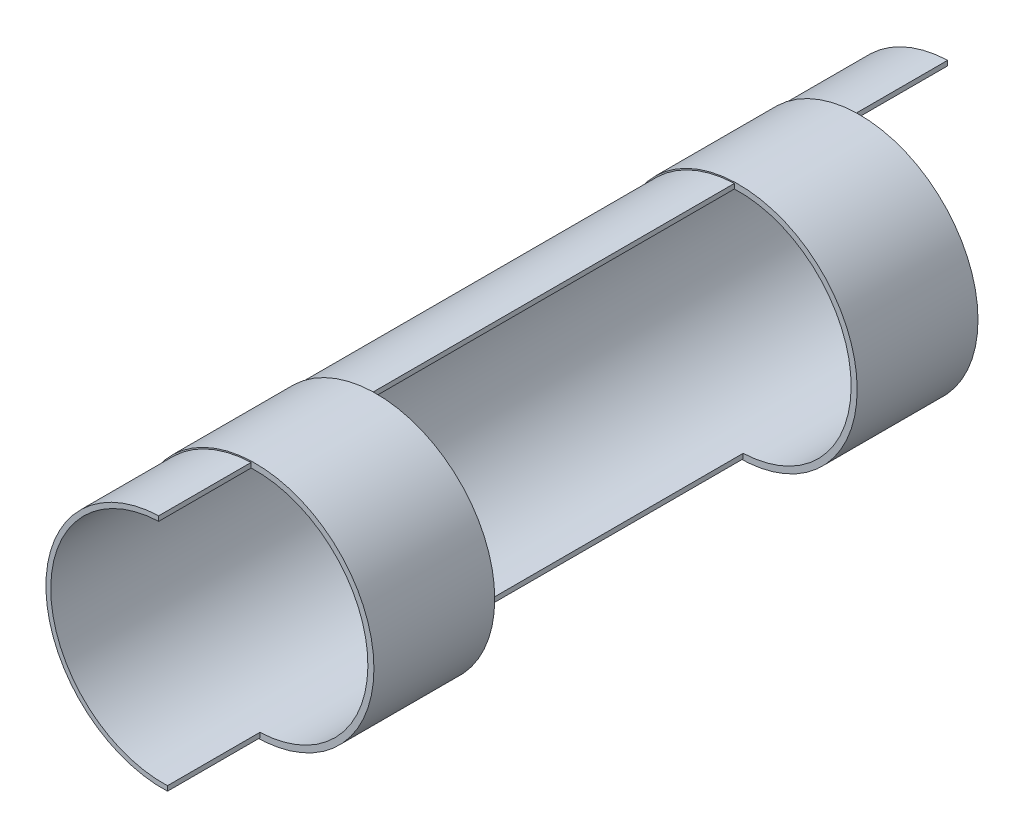
ISO-10303-21;
HEADER;
FILE_DESCRIPTION(('STEP AP214'),'2;1');
FILE_NAME('part.step','',(''),(''),'','','');
FILE_SCHEMA(('AUTOMOTIVE_DESIGN { 1 0 10303 214 1 1 1 1 }'));
ENDSEC;
DATA;
#1=APPLICATION_CONTEXT('core data for automotive mechanical design processes');
#2=APPLICATION_PROTOCOL_DEFINITION('international standard','automotive_design',2000,#1);
#3=PRODUCT_CONTEXT('',#1,'mechanical');
#4=PRODUCT('Part','Part','',(#3));
#5=PRODUCT_RELATED_PRODUCT_CATEGORY('part','',(#4));
#6=PRODUCT_DEFINITION_FORMATION('','',#4);
#7=PRODUCT_DEFINITION_CONTEXT('part definition',#1,'design');
#8=PRODUCT_DEFINITION('design','',#6,#7);
#9=PRODUCT_DEFINITION_SHAPE('','',#8);
#10=(LENGTH_UNIT() NAMED_UNIT(*) SI_UNIT(.MILLI.,.METRE.));
#11=(NAMED_UNIT(*) PLANE_ANGLE_UNIT() SI_UNIT($,.RADIAN.));
#12=(NAMED_UNIT(*) SI_UNIT($,.STERADIAN.) SOLID_ANGLE_UNIT());
#13=UNCERTAINTY_MEASURE_WITH_UNIT(LENGTH_MEASURE(1.E-05),#10,'distance_accuracy_value','');
#14=(GEOMETRIC_REPRESENTATION_CONTEXT(3) GLOBAL_UNCERTAINTY_ASSIGNED_CONTEXT((#13)) GLOBAL_UNIT_ASSIGNED_CONTEXT((#10,
#11,#12)) REPRESENTATION_CONTEXT('',''));
#15=CARTESIAN_POINT('',(0.,0.,0.));
#16=DIRECTION('',(0.,0.,1.));
#17=DIRECTION('',(1.,0.,0.));
#18=AXIS2_PLACEMENT_3D('',#15,#16,#17);
#19=CARTESIAN_POINT('',(-0.361769768121218,9.69325139645483,32.65));
#20=DIRECTION('',(1.,0.,0.));
#21=DIRECTION('',(0.,0.,-1.));
#22=AXIS2_PLACEMENT_3D('',#19,#20,#21);
#23=PLANE('',#22);
#24=DIRECTION('',(0.,0.,-1.));
#25=VECTOR('',#24,1.);
#26=CARTESIAN_POINT('',(-0.361769768121218,9.69325139645483,32.65));
#27=LINE('',#26,#25);
#28=CARTESIAN_POINT('',(-0.361769768121218,9.69325139645483,-25.));
#29=VERTEX_POINT('',#28);
#30=CARTESIAN_POINT('',(-0.361769768121218,9.69325139645483,-32.65));
#31=VERTEX_POINT('',#30);
#32=EDGE_CURVE('E48',#29,#31,#27,.T.);
#33=ORIENTED_EDGE('',*,*,#32,.F.);
#34=DIRECTION('',(0.,-1.,0.));
#35=VECTOR('',#34,1.);
#36=CARTESIAN_POINT('',(-0.361769768121218,9.69325139645483,-25.));
#37=LINE('',#36,#35);
#38=CARTESIAN_POINT('',(-0.361769768121218,9.29296091861327,-25.));
#39=VERTEX_POINT('',#38);
#40=EDGE_CURVE('E131',#29,#39,#37,.T.);
#41=ORIENTED_EDGE('',*,*,#40,.T.);
#42=DIRECTION('',(0.,0.,-1.));
#43=VECTOR('',#42,1.);
#44=CARTESIAN_POINT('',(-0.361769768121218,9.29296091861327,32.65));
#45=LINE('',#44,#43);
#46=CARTESIAN_POINT('',(-0.361769768121218,9.29296091861327,-32.65));
#47=VERTEX_POINT('',#46);
#48=EDGE_CURVE('E141',#39,#47,#45,.T.);
#49=ORIENTED_EDGE('',*,*,#48,.T.);
#50=DIRECTION('',(0.,-1.,0.));
#51=VECTOR('',#50,1.);
#52=CARTESIAN_POINT('',(-0.361769768121218,9.69325139645483,-32.65));
#53=LINE('',#52,#51);
#54=EDGE_CURVE('E191',#31,#47,#53,.T.);
#55=ORIENTED_EDGE('',*,*,#54,.F.);
#56=EDGE_LOOP('',(#33,#41,#49,#55));
#57=FACE_BOUND('',#56,.T.);
#58=ADVANCED_FACE('F37',(#57),#23,.T.);
#59=CARTESIAN_POINT('',(0.,0.,32.65));
#60=DIRECTION('',(0.,0.,-1.));
#61=DIRECTION('',(-1.,0.,0.));
#62=AXIS2_PLACEMENT_3D('',#59,#60,#61);
#63=CYLINDRICAL_SURFACE('',#62,9.7);
#64=CARTESIAN_POINT('',(0.,0.,-25.));
#65=DIRECTION('',(0.,0.,1.));
#66=DIRECTION('',(1.,0.,0.));
#67=AXIS2_PLACEMENT_3D('',#64,#65,#66);
#68=CIRCLE('',#67,9.7);
#69=CARTESIAN_POINT('',(0.361769768121218,-9.69325139645483,-25.));
#70=VERTEX_POINT('',#69);
#71=EDGE_CURVE('E144',#29,#70,#68,.T.);
#72=ORIENTED_EDGE('',*,*,#71,.F.);
#73=ORIENTED_EDGE('',*,*,#32,.T.);
#74=CARTESIAN_POINT('',(0.,0.,-32.65));
#75=DIRECTION('',(0.,0.,1.));
#76=DIRECTION('',(1.,0.,0.));
#77=AXIS2_PLACEMENT_3D('',#74,#75,#76);
#78=CIRCLE('',#77,9.7);
#79=CARTESIAN_POINT('',(0.361769768121218,-9.69325139645483,-32.65));
#80=VERTEX_POINT('',#79);
#81=EDGE_CURVE('E184',#31,#80,#78,.T.);
#82=ORIENTED_EDGE('',*,*,#81,.T.);
#83=DIRECTION('',(0.,0.,-1.));
#84=VECTOR('',#83,1.);
#85=CARTESIAN_POINT('',(0.361769768121218,-9.69325139645483,32.65));
#86=LINE('',#85,#84);
#87=EDGE_CURVE('E165',#70,#80,#86,.T.);
#88=ORIENTED_EDGE('',*,*,#87,.F.);
#89=EDGE_LOOP('',(#72,#73,#82,#88));
#90=FACE_BOUND('',#89,.T.);
#91=ADVANCED_FACE('F266',(#90),#63,.T.);
#92=CARTESIAN_POINT('',(0.361769768121218,-9.29296091861327,32.65));
#93=DIRECTION('',(1.,0.,0.));
#94=DIRECTION('',(0.,1.,0.));
#95=AXIS2_PLACEMENT_3D('',#92,#93,#94);
#96=PLANE('',#95);
#97=DIRECTION('',(0.,0.,-1.));
#98=VECTOR('',#97,1.);
#99=CARTESIAN_POINT('',(0.361769768121213,-9.29296091861327,32.65));
#100=LINE('',#99,#98);
#101=CARTESIAN_POINT('',(0.361769768121213,-9.29296091861327,-25.));
#102=VERTEX_POINT('',#101);
#103=CARTESIAN_POINT('',(0.361769768121213,-9.29296091861327,-32.65));
#104=VERTEX_POINT('',#103);
#105=EDGE_CURVE('E156',#102,#104,#100,.T.);
#106=ORIENTED_EDGE('',*,*,#105,.F.);
#107=DIRECTION('',(0.,-1.,0.));
#108=VECTOR('',#107,1.);
#109=CARTESIAN_POINT('',(0.361769768121218,-9.29296091861327,-25.));
#110=LINE('',#109,#108);
#111=EDGE_CURVE('E134',#102,#70,#110,.T.);
#112=ORIENTED_EDGE('',*,*,#111,.T.);
#113=ORIENTED_EDGE('',*,*,#87,.T.);
#114=DIRECTION('',(0.,-1.,0.));
#115=VECTOR('',#114,1.);
#116=CARTESIAN_POINT('',(0.361769768121218,-9.29296091861327,-32.65));
#117=LINE('',#116,#115);
#118=EDGE_CURVE('E187',#104,#80,#117,.T.);
#119=ORIENTED_EDGE('',*,*,#118,.F.);
#120=EDGE_LOOP('',(#106,#112,#113,#119));
#121=FACE_BOUND('',#120,.T.);
#122=ADVANCED_FACE('F270',(#121),#96,.T.);
#123=DIRECTION('',(0.,-1.,0.));
#124=VECTOR('',#123,1.);
#125=CARTESIAN_POINT('',(-0.361769768121218,9.69325139645483,-15.));
#126=LINE('',#125,#124);
#127=CARTESIAN_POINT('',(-0.361769768121218,9.69325139645483,-15.));
#128=VERTEX_POINT('',#127);
#129=CARTESIAN_POINT('',(-0.361769768121218,9.29296091861327,-15.));
#130=VERTEX_POINT('',#129);
#131=EDGE_CURVE('E220',#128,#130,#126,.T.);
#132=ORIENTED_EDGE('',*,*,#131,.F.);
#133=CARTESIAN_POINT('',(-0.361769768121218,9.69325139645483,15.));
#134=VERTEX_POINT('',#133);
#135=EDGE_CURVE('E46',#134,#128,#27,.T.);
#136=ORIENTED_EDGE('',*,*,#135,.F.);
#137=DIRECTION('',(0.,-1.,0.));
#138=VECTOR('',#137,1.);
#139=CARTESIAN_POINT('',(-0.361769768121218,9.69325139645483,15.));
#140=LINE('',#139,#138);
#141=CARTESIAN_POINT('',(-0.361769768121218,9.29296091861327,15.));
#142=VERTEX_POINT('',#141);
#143=EDGE_CURVE('E204',#134,#142,#140,.T.);
#144=ORIENTED_EDGE('',*,*,#143,.T.);
#145=EDGE_CURVE('E150',#142,#130,#45,.T.);
#146=ORIENTED_EDGE('',*,*,#145,.T.);
#147=EDGE_LOOP('',(#132,#136,#144,#146));
#148=FACE_BOUND('',#147,.T.);
#149=ADVANCED_FACE('F241',(#148),#23,.T.);
#150=ORIENTED_EDGE('',*,*,#135,.T.);
#151=CARTESIAN_POINT('',(0.,0.,-15.));
#152=DIRECTION('',(0.,0.,1.));
#153=DIRECTION('',(1.,0.,0.));
#154=AXIS2_PLACEMENT_3D('',#151,#152,#153);
#155=CIRCLE('',#154,9.7);
#156=CARTESIAN_POINT('',(0.361769768121218,-9.69325139645483,-15.));
#157=VERTEX_POINT('',#156);
#158=EDGE_CURVE('E223',#128,#157,#155,.T.);
#159=ORIENTED_EDGE('',*,*,#158,.T.);
#160=CARTESIAN_POINT('',(0.361769768121218,-9.69325139645483,15.));
#161=VERTEX_POINT('',#160);
#162=EDGE_CURVE('E169',#161,#157,#86,.T.);
#163=ORIENTED_EDGE('',*,*,#162,.F.);
#164=CARTESIAN_POINT('',(0.,0.,15.));
#165=DIRECTION('',(0.,0.,1.));
#166=DIRECTION('',(1.,0.,0.));
#167=AXIS2_PLACEMENT_3D('',#164,#165,#166);
#168=CIRCLE('',#167,9.7);
#169=EDGE_CURVE('E207',#134,#161,#168,.T.);
#170=ORIENTED_EDGE('',*,*,#169,.F.);
#171=EDGE_LOOP('',(#150,#159,#163,#170));
#172=FACE_BOUND('',#171,.T.);
#173=ADVANCED_FACE('F249',(#172),#63,.T.);
#174=DIRECTION('',(0.,-1.,0.));
#175=VECTOR('',#174,1.);
#176=CARTESIAN_POINT('',(0.361769768121218,-9.29296091861327,-15.));
#177=LINE('',#176,#175);
#178=CARTESIAN_POINT('',(0.361769768121213,-9.29296091861327,-15.));
#179=VERTEX_POINT('',#178);
#180=EDGE_CURVE('E143',#179,#157,#177,.T.);
#181=ORIENTED_EDGE('',*,*,#180,.F.);
#182=CARTESIAN_POINT('',(0.361769768121213,-9.29296091861327,15.));
#183=VERTEX_POINT('',#182);
#184=EDGE_CURVE('E160',#183,#179,#100,.T.);
#185=ORIENTED_EDGE('',*,*,#184,.F.);
#186=DIRECTION('',(0.,-1.,0.));
#187=VECTOR('',#186,1.);
#188=CARTESIAN_POINT('',(0.361769768121218,-9.29296091861327,15.));
#189=LINE('',#188,#187);
#190=EDGE_CURVE('E209',#183,#161,#189,.T.);
#191=ORIENTED_EDGE('',*,*,#190,.T.);
#192=ORIENTED_EDGE('',*,*,#162,.T.);
#193=EDGE_LOOP('',(#181,#185,#191,#192));
#194=FACE_BOUND('',#193,.T.);
#195=ADVANCED_FACE('F251',(#194),#96,.T.);
#196=DIRECTION('',(0.,-1.,0.));
#197=VECTOR('',#196,1.);
#198=CARTESIAN_POINT('',(-0.361769768121218,9.69325139645483,25.));
#199=LINE('',#198,#197);
#200=CARTESIAN_POINT('',(-0.361769768121218,9.69325139645483,25.));
#201=VERTEX_POINT('',#200);
#202=CARTESIAN_POINT('',(-0.361769768121218,9.29296091861327,25.));
#203=VERTEX_POINT('',#202);
#204=EDGE_CURVE('E192',#201,#203,#199,.T.);
#205=ORIENTED_EDGE('',*,*,#204,.F.);
#206=CARTESIAN_POINT('',(-0.361769768121218,9.69325139645483,32.65));
#207=VERTEX_POINT('',#206);
#208=EDGE_CURVE('E11',#207,#201,#27,.T.);
#209=ORIENTED_EDGE('',*,*,#208,.F.);
#210=DIRECTION('',(0.,-1.,0.));
#211=VECTOR('',#210,1.);
#212=CARTESIAN_POINT('',(-0.361769768121218,9.69325139645483,32.65));
#213=LINE('',#212,#211);
#214=CARTESIAN_POINT('',(-0.361769768121218,9.29296091861327,32.65));
#215=VERTEX_POINT('',#214);
#216=EDGE_CURVE('E186',#207,#215,#213,.T.);
#217=ORIENTED_EDGE('',*,*,#216,.T.);
#218=EDGE_CURVE('E41',#215,#203,#45,.T.);
#219=ORIENTED_EDGE('',*,*,#218,.T.);
#220=EDGE_LOOP('',(#205,#209,#217,#219));
#221=FACE_BOUND('',#220,.T.);
#222=ADVANCED_FACE('F39',(#221),#23,.T.);
#223=ORIENTED_EDGE('',*,*,#208,.T.);
#224=CARTESIAN_POINT('',(0.,0.,25.));
#225=DIRECTION('',(0.,0.,1.));
#226=DIRECTION('',(1.,0.,0.));
#227=AXIS2_PLACEMENT_3D('',#224,#225,#226);
#228=CIRCLE('',#227,9.7);
#229=CARTESIAN_POINT('',(0.361769768121218,-9.69325139645483,25.));
#230=VERTEX_POINT('',#229);
#231=EDGE_CURVE('E199',#201,#230,#228,.T.);
#232=ORIENTED_EDGE('',*,*,#231,.T.);
#233=CARTESIAN_POINT('',(0.361769768121218,-9.69325139645483,32.65));
#234=VERTEX_POINT('',#233);
#235=EDGE_CURVE('E170',#234,#230,#86,.T.);
#236=ORIENTED_EDGE('',*,*,#235,.F.);
#237=CARTESIAN_POINT('',(0.,0.,32.65));
#238=DIRECTION('',(0.,0.,1.));
#239=DIRECTION('',(1.,0.,0.));
#240=AXIS2_PLACEMENT_3D('',#237,#238,#239);
#241=CIRCLE('',#240,9.7);
#242=EDGE_CURVE('E151',#207,#234,#241,.T.);
#243=ORIENTED_EDGE('',*,*,#242,.F.);
#244=EDGE_LOOP('',(#223,#232,#236,#243));
#245=FACE_BOUND('',#244,.T.);
#246=ADVANCED_FACE('F272',(#245),#63,.T.);
#247=DIRECTION('',(0.,-1.,0.));
#248=VECTOR('',#247,1.);
#249=CARTESIAN_POINT('',(0.361769768121218,-9.29296091861327,25.));
#250=LINE('',#249,#248);
#251=CARTESIAN_POINT('',(0.361769768121213,-9.29296091861327,25.));
#252=VERTEX_POINT('',#251);
#253=EDGE_CURVE('E202',#252,#230,#250,.T.);
#254=ORIENTED_EDGE('',*,*,#253,.F.);
#255=CARTESIAN_POINT('',(0.361769768121213,-9.29296091861327,32.65));
#256=VERTEX_POINT('',#255);
#257=EDGE_CURVE('E161',#256,#252,#100,.T.);
#258=ORIENTED_EDGE('',*,*,#257,.F.);
#259=DIRECTION('',(0.,-1.,0.));
#260=VECTOR('',#259,1.);
#261=CARTESIAN_POINT('',(0.361769768121218,-9.29296091861327,32.65));
#262=LINE('',#261,#260);
#263=EDGE_CURVE('E153',#256,#234,#262,.T.);
#264=ORIENTED_EDGE('',*,*,#263,.T.);
#265=ORIENTED_EDGE('',*,*,#235,.T.);
#266=EDGE_LOOP('',(#254,#258,#264,#265));
#267=FACE_BOUND('',#266,.T.);
#268=ADVANCED_FACE('F279',(#267),#96,.T.);
#269=CARTESIAN_POINT('',(0.,0.,32.65));
#270=DIRECTION('',(0.,0.,-1.));
#271=DIRECTION('',(-1.,0.,0.));
#272=AXIS2_PLACEMENT_3D('',#269,#270,#271);
#273=CYLINDRICAL_SURFACE('',#272,9.3);
#274=ORIENTED_EDGE('',*,*,#48,.F.);
#275=CARTESIAN_POINT('',(0.,0.,-25.));
#276=DIRECTION('',(0.,0.,1.));
#277=DIRECTION('',(1.,0.,0.));
#278=AXIS2_PLACEMENT_3D('',#275,#276,#277);
#279=CIRCLE('',#278,9.3);
#280=EDGE_CURVE('E55',#102,#39,#279,.T.);
#281=ORIENTED_EDGE('',*,*,#280,.F.);
#282=ORIENTED_EDGE('',*,*,#105,.T.);
#283=CARTESIAN_POINT('',(0.,0.,-32.65));
#284=DIRECTION('',(0.,0.,1.));
#285=DIRECTION('',(1.,0.,0.));
#286=AXIS2_PLACEMENT_3D('',#283,#284,#285);
#287=CIRCLE('',#286,9.3);
#288=EDGE_CURVE('E148',#47,#104,#287,.T.);
#289=ORIENTED_EDGE('',*,*,#288,.F.);
#290=EDGE_LOOP('',(#274,#281,#282,#289));
#291=FACE_BOUND('',#290,.T.);
#292=ORIENTED_EDGE('',*,*,#184,.T.);
#293=CARTESIAN_POINT('',(0.,0.,-15.));
#294=DIRECTION('',(0.,0.,1.));
#295=DIRECTION('',(1.,0.,0.));
#296=AXIS2_PLACEMENT_3D('',#293,#294,#295);
#297=CIRCLE('',#296,9.3);
#298=EDGE_CURVE('E136',#179,#130,#297,.T.);
#299=ORIENTED_EDGE('',*,*,#298,.T.);
#300=ORIENTED_EDGE('',*,*,#145,.F.);
#301=CARTESIAN_POINT('',(0.,0.,15.));
#302=DIRECTION('',(0.,0.,1.));
#303=DIRECTION('',(1.,0.,0.));
#304=AXIS2_PLACEMENT_3D('',#301,#302,#303);
#305=CIRCLE('',#304,9.3);
#306=EDGE_CURVE('E63',#183,#142,#305,.T.);
#307=ORIENTED_EDGE('',*,*,#306,.F.);
#308=EDGE_LOOP('',(#292,#299,#300,#307));
#309=FACE_BOUND('',#308,.T.);
#310=ORIENTED_EDGE('',*,*,#257,.T.);
#311=CARTESIAN_POINT('',(0.,0.,25.));
#312=DIRECTION('',(0.,0.,1.));
#313=DIRECTION('',(1.,0.,0.));
#314=AXIS2_PLACEMENT_3D('',#311,#312,#313);
#315=CIRCLE('',#314,9.3);
#316=EDGE_CURVE('E216',#252,#203,#315,.T.);
#317=ORIENTED_EDGE('',*,*,#316,.T.);
#318=ORIENTED_EDGE('',*,*,#218,.F.);
#319=CARTESIAN_POINT('',(0.,0.,32.65));
#320=DIRECTION('',(0.,0.,1.));
#321=DIRECTION('',(1.,0.,0.));
#322=AXIS2_PLACEMENT_3D('',#319,#320,#321);
#323=CIRCLE('',#322,9.3);
#324=EDGE_CURVE('E195',#215,#256,#323,.T.);
#325=ORIENTED_EDGE('',*,*,#324,.T.);
#326=EDGE_LOOP('',(#310,#317,#318,#325));
#327=FACE_BOUND('',#326,.T.);
#328=ADVANCED_FACE('F146',(#291,#309,#327),#273,.F.);
#329=CARTESIAN_POINT('',(0.,0.,32.65));
#330=DIRECTION('',(0.,0.,1.));
#331=DIRECTION('',(1.,0.,0.));
#332=AXIS2_PLACEMENT_3D('',#329,#330,#331);
#333=PLANE('',#332);
#334=ORIENTED_EDGE('',*,*,#216,.F.);
#335=ORIENTED_EDGE('',*,*,#242,.T.);
#336=ORIENTED_EDGE('',*,*,#263,.F.);
#337=ORIENTED_EDGE('',*,*,#324,.F.);
#338=EDGE_LOOP('',(#334,#335,#336,#337));
#339=FACE_BOUND('',#338,.T.);
#340=ADVANCED_FACE('F288',(#339),#333,.T.);
#341=CARTESIAN_POINT('',(0.,0.,-32.65));
#342=DIRECTION('',(0.,0.,1.));
#343=DIRECTION('',(1.,0.,0.));
#344=AXIS2_PLACEMENT_3D('',#341,#342,#343);
#345=PLANE('',#344);
#346=ORIENTED_EDGE('',*,*,#54,.T.);
#347=ORIENTED_EDGE('',*,*,#288,.T.);
#348=ORIENTED_EDGE('',*,*,#118,.T.);
#349=ORIENTED_EDGE('',*,*,#81,.F.);
#350=EDGE_LOOP('',(#346,#347,#348,#349));
#351=FACE_BOUND('',#350,.T.);
#352=ADVANCED_FACE('F298',(#351),#345,.F.);
#353=CARTESIAN_POINT('',(0.,0.,25.));
#354=DIRECTION('',(0.,0.,1.));
#355=DIRECTION('',(1.,0.,0.));
#356=AXIS2_PLACEMENT_3D('',#353,#354,#355);
#357=PLANE('',#356);
#358=CARTESIAN_POINT('',(0.,0.,25.));
#359=DIRECTION('',(0.,0.,1.));
#360=DIRECTION('',(1.,0.,0.));
#361=AXIS2_PLACEMENT_3D('',#358,#359,#360);
#362=CIRCLE('',#361,9.8);
#363=CARTESIAN_POINT('',(9.8,0.,25.));
#364=VERTEX_POINT('',#363);
#365=EDGE_CURVE('E212',#364,#364,#362,.T.);
#366=ORIENTED_EDGE('',*,*,#365,.T.);
#367=EDGE_LOOP('',(#366));
#368=FACE_BOUND('',#367,.T.);
#369=ORIENTED_EDGE('',*,*,#231,.F.);
#370=ORIENTED_EDGE('',*,*,#204,.T.);
#371=ORIENTED_EDGE('',*,*,#316,.F.);
#372=ORIENTED_EDGE('',*,*,#253,.T.);
#373=EDGE_LOOP('',(#369,#370,#371,#372));
#374=FACE_BOUND('',#373,.T.);
#375=ADVANCED_FACE('F289',(#368,#374),#357,.T.);
#376=CARTESIAN_POINT('',(0.,0.,15.));
#377=DIRECTION('',(0.,0.,1.));
#378=DIRECTION('',(1.,0.,0.));
#379=AXIS2_PLACEMENT_3D('',#376,#377,#378);
#380=PLANE('',#379);
#381=ORIENTED_EDGE('',*,*,#143,.F.);
#382=ORIENTED_EDGE('',*,*,#169,.T.);
#383=ORIENTED_EDGE('',*,*,#190,.F.);
#384=ORIENTED_EDGE('',*,*,#306,.T.);
#385=EDGE_LOOP('',(#381,#382,#383,#384));
#386=FACE_BOUND('',#385,.T.);
#387=CARTESIAN_POINT('',(0.,0.,15.));
#388=DIRECTION('',(0.,0.,1.));
#389=DIRECTION('',(1.,0.,0.));
#390=AXIS2_PLACEMENT_3D('',#387,#388,#389);
#391=CIRCLE('',#390,9.8);
#392=CARTESIAN_POINT('',(9.8,0.,15.));
#393=VERTEX_POINT('',#392);
#394=EDGE_CURVE('E213',#393,#393,#391,.T.);
#395=ORIENTED_EDGE('',*,*,#394,.F.);
#396=EDGE_LOOP('',(#395));
#397=FACE_BOUND('',#396,.T.);
#398=ADVANCED_FACE('F245',(#386,#397),#380,.F.);
#399=CARTESIAN_POINT('',(0.,0.,25.));
#400=DIRECTION('',(0.,0.,-1.));
#401=DIRECTION('',(-1.,0.,0.));
#402=AXIS2_PLACEMENT_3D('',#399,#400,#401);
#403=CYLINDRICAL_SURFACE('',#402,9.8);
#404=ORIENTED_EDGE('',*,*,#365,.F.);
#405=EDGE_LOOP('',(#404));
#406=FACE_BOUND('',#405,.T.);
#407=ORIENTED_EDGE('',*,*,#394,.T.);
#408=EDGE_LOOP('',(#407));
#409=FACE_BOUND('',#408,.T.);
#410=ADVANCED_FACE('F254',(#406,#409),#403,.T.);
#411=CARTESIAN_POINT('',(0.,0.,-15.));
#412=DIRECTION('',(0.,0.,1.));
#413=DIRECTION('',(1.,0.,0.));
#414=AXIS2_PLACEMENT_3D('',#411,#412,#413);
#415=PLANE('',#414);
#416=CARTESIAN_POINT('',(0.,0.,-15.));
#417=DIRECTION('',(0.,0.,1.));
#418=DIRECTION('',(1.,0.,0.));
#419=AXIS2_PLACEMENT_3D('',#416,#417,#418);
#420=CIRCLE('',#419,9.8);
#421=CARTESIAN_POINT('',(9.8,0.,-15.));
#422=VERTEX_POINT('',#421);
#423=EDGE_CURVE('E229',#422,#422,#420,.T.);
#424=ORIENTED_EDGE('',*,*,#423,.T.);
#425=EDGE_LOOP('',(#424));
#426=FACE_BOUND('',#425,.T.);
#427=ORIENTED_EDGE('',*,*,#158,.F.);
#428=ORIENTED_EDGE('',*,*,#131,.T.);
#429=ORIENTED_EDGE('',*,*,#298,.F.);
#430=ORIENTED_EDGE('',*,*,#180,.T.);
#431=EDGE_LOOP('',(#427,#428,#429,#430));
#432=FACE_BOUND('',#431,.T.);
#433=ADVANCED_FACE('F252',(#426,#432),#415,.T.);
#434=CARTESIAN_POINT('',(0.,0.,-25.));
#435=DIRECTION('',(0.,0.,1.));
#436=DIRECTION('',(1.,0.,0.));
#437=AXIS2_PLACEMENT_3D('',#434,#435,#436);
#438=PLANE('',#437);
#439=ORIENTED_EDGE('',*,*,#40,.F.);
#440=ORIENTED_EDGE('',*,*,#71,.T.);
#441=ORIENTED_EDGE('',*,*,#111,.F.);
#442=ORIENTED_EDGE('',*,*,#280,.T.);
#443=EDGE_LOOP('',(#439,#440,#441,#442));
#444=FACE_BOUND('',#443,.T.);
#445=CARTESIAN_POINT('',(0.,0.,-25.));
#446=DIRECTION('',(0.,0.,1.));
#447=DIRECTION('',(1.,0.,0.));
#448=AXIS2_PLACEMENT_3D('',#445,#446,#447);
#449=CIRCLE('',#448,9.8);
#450=CARTESIAN_POINT('',(9.8,0.,-25.));
#451=VERTEX_POINT('',#450);
#452=EDGE_CURVE('E230',#451,#451,#449,.T.);
#453=ORIENTED_EDGE('',*,*,#452,.F.);
#454=EDGE_LOOP('',(#453));
#455=FACE_BOUND('',#454,.T.);
#456=ADVANCED_FACE('F129',(#444,#455),#438,.F.);
#457=CARTESIAN_POINT('',(0.,0.,-15.));
#458=DIRECTION('',(0.,0.,-1.));
#459=DIRECTION('',(-1.,0.,0.));
#460=AXIS2_PLACEMENT_3D('',#457,#458,#459);
#461=CYLINDRICAL_SURFACE('',#460,9.8);
#462=ORIENTED_EDGE('',*,*,#423,.F.);
#463=EDGE_LOOP('',(#462));
#464=FACE_BOUND('',#463,.T.);
#465=ORIENTED_EDGE('',*,*,#452,.T.);
#466=EDGE_LOOP('',(#465));
#467=FACE_BOUND('',#466,.T.);
#468=ADVANCED_FACE('F261',(#464,#467),#461,.T.);
#469=CLOSED_SHELL('',(#58,#91,#122,#149,#173,#195,#222,#246,#268,#328,#340,#352,#375,#398,#410,
#433,#456,#468));
#470=MANIFOLD_SOLID_BREP('B2',#469);
#471=ADVANCED_BREP_SHAPE_REPRESENTATION('',(#18,#470),#14);
#472=SHAPE_DEFINITION_REPRESENTATION(#9,#471);
ENDSEC;
END-ISO-10303-21;
